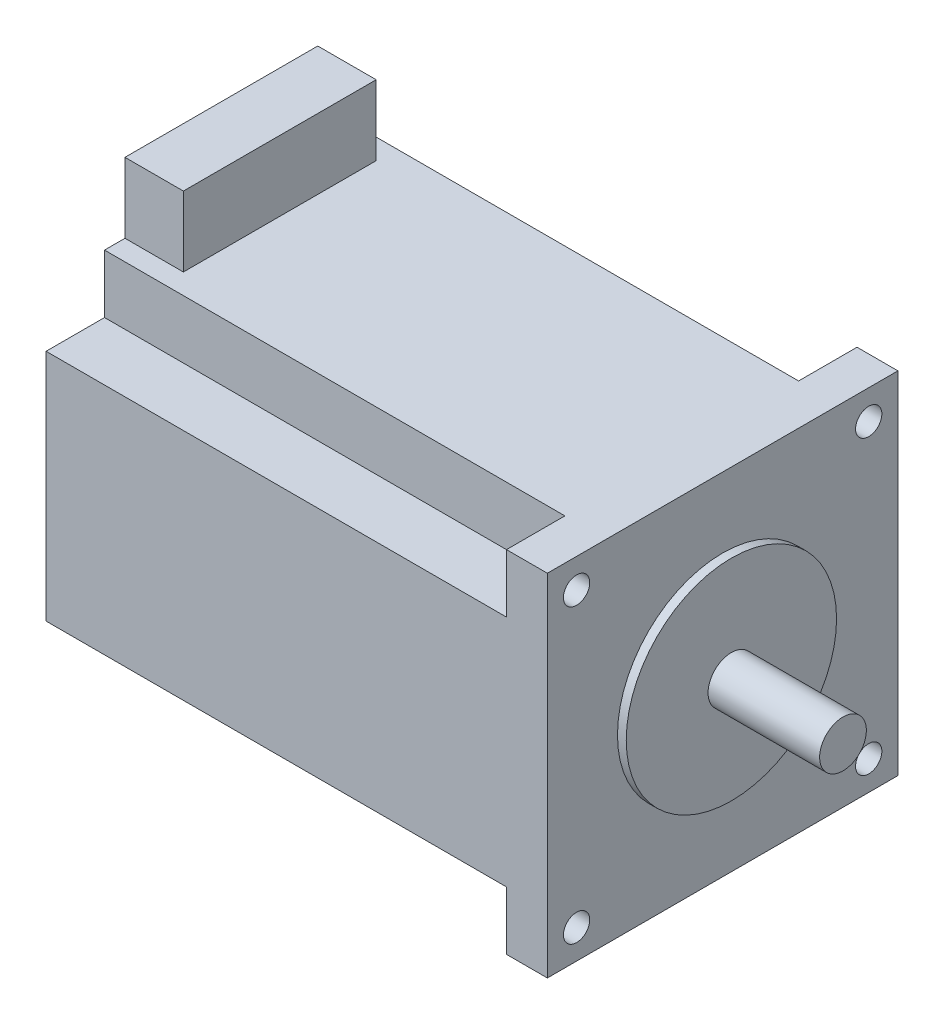
ISO-10303-21;
HEADER;
FILE_DESCRIPTION(('STEP AP214'),'2;1');
FILE_NAME('part.step','',(''),(''),'','','');
FILE_SCHEMA(('AUTOMOTIVE_DESIGN { 1 0 10303 214 1 1 1 1 }'));
ENDSEC;
DATA;
#1=APPLICATION_CONTEXT('core data for automotive mechanical design processes');
#2=APPLICATION_PROTOCOL_DEFINITION('international standard','automotive_design',2000,#1);
#3=PRODUCT_CONTEXT('',#1,'mechanical');
#4=PRODUCT('Part','Part','',(#3));
#5=PRODUCT_RELATED_PRODUCT_CATEGORY('part','',(#4));
#6=PRODUCT_DEFINITION_FORMATION('','',#4);
#7=PRODUCT_DEFINITION_CONTEXT('part definition',#1,'design');
#8=PRODUCT_DEFINITION('design','',#6,#7);
#9=PRODUCT_DEFINITION_SHAPE('','',#8);
#10=(LENGTH_UNIT() NAMED_UNIT(*) SI_UNIT(.MILLI.,.METRE.));
#11=(NAMED_UNIT(*) PLANE_ANGLE_UNIT() SI_UNIT($,.RADIAN.));
#12=(NAMED_UNIT(*) SI_UNIT($,.STERADIAN.) SOLID_ANGLE_UNIT());
#13=UNCERTAINTY_MEASURE_WITH_UNIT(LENGTH_MEASURE(1.E-05),#10,'distance_accuracy_value','');
#14=(GEOMETRIC_REPRESENTATION_CONTEXT(3) GLOBAL_UNCERTAINTY_ASSIGNED_CONTEXT((#13)) GLOBAL_UNIT_ASSIGNED_CONTEXT((#10,
#11,#12)) REPRESENTATION_CONTEXT('',''));
#15=CARTESIAN_POINT('',(0.,0.,0.));
#16=DIRECTION('',(0.,0.,1.));
#17=DIRECTION('',(1.,0.,0.));
#18=AXIS2_PLACEMENT_3D('',#15,#16,#17);
#19=CARTESIAN_POINT('',(-0.199999999999992,4.99999999999997,25.));
#20=DIRECTION('',(1.,0.,0.));
#21=DIRECTION('',(0.,1.,0.));
#22=AXIS2_PLACEMENT_3D('',#19,#20,#21);
#23=CYLINDRICAL_SURFACE('',#22,2.25);
#24=CARTESIAN_POINT('',(85.8,4.99999999999999,25.));
#25=DIRECTION('',(1.,0.,0.));
#26=DIRECTION('',(0.,0.,-1.));
#27=AXIS2_PLACEMENT_3D('',#24,#25,#26);
#28=CIRCLE('',#27,2.25);
#29=CARTESIAN_POINT('',(85.8,4.99999999999999,22.75));
#30=VERTEX_POINT('',#29);
#31=EDGE_CURVE('E283',#30,#30,#28,.T.);
#32=ORIENTED_EDGE('',*,*,#31,.T.);
#33=EDGE_LOOP('',(#32));
#34=FACE_BOUND('',#33,.T.);
#35=CARTESIAN_POINT('',(78.8,4.99999999999999,25.));
#36=DIRECTION('',(-1.,0.,0.));
#37=DIRECTION('',(0.,-1.,0.));
#38=AXIS2_PLACEMENT_3D('',#35,#36,#37);
#39=CIRCLE('',#38,2.25);
#40=CARTESIAN_POINT('',(78.8,2.74999999999999,25.));
#41=VERTEX_POINT('',#40);
#42=EDGE_CURVE('E33',#41,#41,#39,.F.);
#43=ORIENTED_EDGE('',*,*,#42,.F.);
#44=EDGE_LOOP('',(#43));
#45=FACE_BOUND('',#44,.T.);
#46=ADVANCED_FACE('F29',(#34,#45),#23,.F.);
#47=CARTESIAN_POINT('',(-0.200000000000006,55.,-25.));
#48=DIRECTION('',(1.,0.,0.));
#49=DIRECTION('',(0.,1.,0.));
#50=AXIS2_PLACEMENT_3D('',#47,#48,#49);
#51=CYLINDRICAL_SURFACE('',#50,2.25);
#52=CARTESIAN_POINT('',(85.8,55.,-25.));
#53=DIRECTION('',(1.,0.,0.));
#54=DIRECTION('',(0.,0.,-1.));
#55=AXIS2_PLACEMENT_3D('',#52,#53,#54);
#56=CIRCLE('',#55,2.25);
#57=CARTESIAN_POINT('',(85.8,55.,-27.25));
#58=VERTEX_POINT('',#57);
#59=EDGE_CURVE('E286',#58,#58,#56,.T.);
#60=ORIENTED_EDGE('',*,*,#59,.T.);
#61=EDGE_LOOP('',(#60));
#62=FACE_BOUND('',#61,.T.);
#63=CARTESIAN_POINT('',(78.8,55.,-25.));
#64=DIRECTION('',(-1.,0.,0.));
#65=DIRECTION('',(0.,-1.,0.));
#66=AXIS2_PLACEMENT_3D('',#63,#64,#65);
#67=CIRCLE('',#66,2.25);
#68=CARTESIAN_POINT('',(78.8,52.75,-25.));
#69=VERTEX_POINT('',#68);
#70=EDGE_CURVE('E276',#69,#69,#67,.F.);
#71=ORIENTED_EDGE('',*,*,#70,.F.);
#72=EDGE_LOOP('',(#71));
#73=FACE_BOUND('',#72,.T.);
#74=ADVANCED_FACE('F335',(#62,#73),#51,.F.);
#75=CARTESIAN_POINT('',(85.8,32.566827324451,30.));
#76=DIRECTION('',(1.,0.,0.));
#77=DIRECTION('',(0.,1.,0.));
#78=AXIS2_PLACEMENT_3D('',#75,#76,#77);
#79=PLANE('',#78);
#80=CARTESIAN_POINT('',(85.8,5.,-25.));
#81=DIRECTION('',(1.,0.,0.));
#82=DIRECTION('',(0.,0.,-1.));
#83=AXIS2_PLACEMENT_3D('',#80,#81,#82);
#84=CIRCLE('',#83,2.25);
#85=CARTESIAN_POINT('',(85.8,5.,-27.25));
#86=VERTEX_POINT('',#85);
#87=EDGE_CURVE('E280',#86,#86,#84,.T.);
#88=ORIENTED_EDGE('',*,*,#87,.F.);
#89=EDGE_LOOP('',(#88));
#90=FACE_BOUND('',#89,.T.);
#91=ORIENTED_EDGE('',*,*,#31,.F.);
#92=EDGE_LOOP('',(#91));
#93=FACE_BOUND('',#92,.T.);
#94=ORIENTED_EDGE('',*,*,#59,.F.);
#95=EDGE_LOOP('',(#94));
#96=FACE_BOUND('',#95,.T.);
#97=CARTESIAN_POINT('',(85.8,55.,25.));
#98=DIRECTION('',(1.,0.,0.));
#99=DIRECTION('',(0.,0.,-1.));
#100=AXIS2_PLACEMENT_3D('',#97,#98,#99);
#101=CIRCLE('',#100,2.25);
#102=CARTESIAN_POINT('',(85.8,55.,22.75));
#103=VERTEX_POINT('',#102);
#104=EDGE_CURVE('E289',#103,#103,#101,.T.);
#105=ORIENTED_EDGE('',*,*,#104,.F.);
#106=EDGE_LOOP('',(#105));
#107=FACE_BOUND('',#106,.T.);
#108=DIRECTION('',(0.,-1.,0.));
#109=VECTOR('',#108,1.);
#110=CARTESIAN_POINT('',(85.8,32.566827324451,-30.));
#111=LINE('',#110,#109);
#112=CARTESIAN_POINT('',(85.8,60.,-30.));
#113=VERTEX_POINT('',#112);
#114=CARTESIAN_POINT('',(85.8,0.,-30.));
#115=VERTEX_POINT('',#114);
#116=EDGE_CURVE('E420',#113,#115,#111,.T.);
#117=ORIENTED_EDGE('',*,*,#116,.F.);
#118=DIRECTION('',(0.,0.,-1.));
#119=VECTOR('',#118,1.);
#120=CARTESIAN_POINT('',(85.8,60.,30.));
#121=LINE('',#120,#119);
#122=CARTESIAN_POINT('',(85.8,60.,30.));
#123=VERTEX_POINT('',#122);
#124=EDGE_CURVE('E11',#123,#113,#121,.T.);
#125=ORIENTED_EDGE('',*,*,#124,.F.);
#126=DIRECTION('',(0.,-1.,0.));
#127=VECTOR('',#126,1.);
#128=CARTESIAN_POINT('',(85.8,32.566827324451,30.));
#129=LINE('',#128,#127);
#130=CARTESIAN_POINT('',(85.8,0.,30.));
#131=VERTEX_POINT('',#130);
#132=EDGE_CURVE('E201',#123,#131,#129,.T.);
#133=ORIENTED_EDGE('',*,*,#132,.T.);
#134=DIRECTION('',(0.,0.,-1.));
#135=VECTOR('',#134,1.);
#136=CARTESIAN_POINT('',(85.8,0.,30.));
#137=LINE('',#136,#135);
#138=EDGE_CURVE('E198',#131,#115,#137,.T.);
#139=ORIENTED_EDGE('',*,*,#138,.T.);
#140=EDGE_LOOP('',(#117,#125,#133,#139));
#141=FACE_BOUND('',#140,.T.);
#142=CARTESIAN_POINT('',(85.8,30.,0.));
#143=DIRECTION('',(1.,0.,0.));
#144=DIRECTION('',(0.,1.,0.));
#145=AXIS2_PLACEMENT_3D('',#142,#143,#144);
#146=CIRCLE('',#145,18.);
#147=CARTESIAN_POINT('',(85.8,48.,0.));
#148=VERTEX_POINT('',#147);
#149=EDGE_CURVE('E298',#148,#148,#146,.T.);
#150=ORIENTED_EDGE('',*,*,#149,.F.);
#151=EDGE_LOOP('',(#150));
#152=FACE_BOUND('',#151,.T.);
#153=ADVANCED_FACE('F31',(#90,#93,#96,#107,#141,#152),#79,.T.);
#154=CARTESIAN_POINT('',(-52.8710039435466,60.,30.));
#155=DIRECTION('',(0.,-1.,0.));
#156=DIRECTION('',(0.,0.,-1.));
#157=AXIS2_PLACEMENT_3D('',#154,#155,#156);
#158=PLANE('',#157);
#159=DIRECTION('',(0.,0.,-1.));
#160=VECTOR('',#159,1.);
#161=CARTESIAN_POINT('',(0.,60.,30.));
#162=LINE('',#161,#160);
#163=CARTESIAN_POINT('',(0.,60.,20.));
#164=VERTEX_POINT('',#163);
#165=CARTESIAN_POINT('',(0.,60.,16.5));
#166=VERTEX_POINT('',#165);
#167=EDGE_CURVE('E38',#164,#166,#162,.T.);
#168=ORIENTED_EDGE('',*,*,#167,.F.);
#169=DIRECTION('',(-1.,0.,0.));
#170=VECTOR('',#169,1.);
#171=CARTESIAN_POINT('',(78.8,60.,20.));
#172=LINE('',#171,#170);
#173=CARTESIAN_POINT('',(78.8,60.,20.));
#174=VERTEX_POINT('',#173);
#175=EDGE_CURVE('E251',#174,#164,#172,.T.);
#176=ORIENTED_EDGE('',*,*,#175,.F.);
#177=DIRECTION('',(0.,0.,-1.));
#178=VECTOR('',#177,1.);
#179=CARTESIAN_POINT('',(78.8,60.,30.));
#180=LINE('',#179,#178);
#181=CARTESIAN_POINT('',(78.8,60.,30.));
#182=VERTEX_POINT('',#181);
#183=EDGE_CURVE('E243',#182,#174,#180,.T.);
#184=ORIENTED_EDGE('',*,*,#183,.F.);
#185=DIRECTION('',(-1.,0.,0.));
#186=VECTOR('',#185,1.);
#187=CARTESIAN_POINT('',(-52.8710039435466,60.,30.));
#188=LINE('',#187,#186);
#189=EDGE_CURVE('E195',#123,#182,#188,.T.);
#190=ORIENTED_EDGE('',*,*,#189,.F.);
#191=ORIENTED_EDGE('',*,*,#124,.T.);
#192=DIRECTION('',(-1.,0.,0.));
#193=VECTOR('',#192,1.);
#194=CARTESIAN_POINT('',(-52.8710039435466,60.,-30.));
#195=LINE('',#194,#193);
#196=CARTESIAN_POINT('',(78.8,60.,-30.));
#197=VERTEX_POINT('',#196);
#198=EDGE_CURVE('E423',#113,#197,#195,.T.);
#199=ORIENTED_EDGE('',*,*,#198,.T.);
#200=DIRECTION('',(0.,0.,-1.));
#201=VECTOR('',#200,1.);
#202=CARTESIAN_POINT('',(78.8,60.,-30.));
#203=LINE('',#202,#201);
#204=CARTESIAN_POINT('',(78.8,60.,-20.));
#205=VERTEX_POINT('',#204);
#206=EDGE_CURVE('E270',#205,#197,#203,.T.);
#207=ORIENTED_EDGE('',*,*,#206,.F.);
#208=DIRECTION('',(-1.,0.,0.));
#209=VECTOR('',#208,1.);
#210=CARTESIAN_POINT('',(78.8,60.,-20.));
#211=LINE('',#210,#209);
#212=CARTESIAN_POINT('',(0.,60.,-20.));
#213=VERTEX_POINT('',#212);
#214=EDGE_CURVE('E273',#205,#213,#211,.T.);
#215=ORIENTED_EDGE('',*,*,#214,.T.);
#216=CARTESIAN_POINT('',(0.,60.,-16.5));
#217=VERTEX_POINT('',#216);
#218=EDGE_CURVE('E208',#217,#213,#162,.T.);
#219=ORIENTED_EDGE('',*,*,#218,.F.);
#220=DIRECTION('',(-1.,0.,0.));
#221=VECTOR('',#220,1.);
#222=CARTESIAN_POINT('',(-52.8710039435466,60.,-16.5));
#223=LINE('',#222,#221);
#224=CARTESIAN_POINT('',(9.99999999999999,60.,-16.5));
#225=VERTEX_POINT('',#224);
#226=EDGE_CURVE('E304',#225,#217,#223,.T.);
#227=ORIENTED_EDGE('',*,*,#226,.F.);
#228=DIRECTION('',(0.,0.,-1.));
#229=VECTOR('',#228,1.);
#230=CARTESIAN_POINT('',(9.99999999999999,60.,16.5));
#231=LINE('',#230,#229);
#232=CARTESIAN_POINT('',(9.99999999999999,60.,16.5));
#233=VERTEX_POINT('',#232);
#234=EDGE_CURVE('E416',#233,#225,#231,.T.);
#235=ORIENTED_EDGE('',*,*,#234,.F.);
#236=DIRECTION('',(-1.,0.,0.));
#237=VECTOR('',#236,1.);
#238=CARTESIAN_POINT('',(-52.8710039435466,60.,16.5));
#239=LINE('',#238,#237);
#240=EDGE_CURVE('E314',#233,#166,#239,.T.);
#241=ORIENTED_EDGE('',*,*,#240,.T.);
#242=EDGE_LOOP('',(#168,#176,#184,#190,#191,#199,#207,#215,#219,#227,#235,#241));
#243=FACE_BOUND('',#242,.T.);
#244=ADVANCED_FACE('F344',(#243),#158,.F.);
#245=CARTESIAN_POINT('',(0.,32.566827324451,30.));
#246=DIRECTION('',(1.,0.,0.));
#247=DIRECTION('',(0.,1.,0.));
#248=AXIS2_PLACEMENT_3D('',#245,#246,#247);
#249=PLANE('',#248);
#250=DIRECTION('',(0.,0.,-1.));
#251=VECTOR('',#250,1.);
#252=CARTESIAN_POINT('',(0.,0.,30.));
#253=LINE('',#252,#251);
#254=CARTESIAN_POINT('',(0.,0.,20.));
#255=VERTEX_POINT('',#254);
#256=CARTESIAN_POINT('',(0.,0.,-20.));
#257=VERTEX_POINT('',#256);
#258=EDGE_CURVE('E206',#255,#257,#253,.T.);
#259=ORIENTED_EDGE('',*,*,#258,.F.);
#260=DIRECTION('',(0.,-1.,0.));
#261=VECTOR('',#260,1.);
#262=CARTESIAN_POINT('',(0.,0.,20.));
#263=LINE('',#262,#261);
#264=CARTESIAN_POINT('',(0.,10.,20.));
#265=VERTEX_POINT('',#264);
#266=EDGE_CURVE('E187',#265,#255,#263,.T.);
#267=ORIENTED_EDGE('',*,*,#266,.F.);
#268=DIRECTION('',(0.,0.,-1.));
#269=VECTOR('',#268,1.);
#270=CARTESIAN_POINT('',(0.,10.,30.));
#271=LINE('',#270,#269);
#272=CARTESIAN_POINT('',(0.,10.,30.));
#273=VERTEX_POINT('',#272);
#274=EDGE_CURVE('E173',#273,#265,#271,.T.);
#275=ORIENTED_EDGE('',*,*,#274,.F.);
#276=DIRECTION('',(0.,-1.,0.));
#277=VECTOR('',#276,1.);
#278=CARTESIAN_POINT('',(0.,32.566827324451,30.));
#279=LINE('',#278,#277);
#280=CARTESIAN_POINT('',(0.,50.,30.));
#281=VERTEX_POINT('',#280);
#282=EDGE_CURVE('E186',#281,#273,#279,.T.);
#283=ORIENTED_EDGE('',*,*,#282,.F.);
#284=DIRECTION('',(0.,0.,1.));
#285=VECTOR('',#284,1.);
#286=CARTESIAN_POINT('',(0.,50.,30.));
#287=LINE('',#286,#285);
#288=CARTESIAN_POINT('',(0.,50.,20.));
#289=VERTEX_POINT('',#288);
#290=EDGE_CURVE('E224',#289,#281,#287,.T.);
#291=ORIENTED_EDGE('',*,*,#290,.F.);
#292=DIRECTION('',(0.,-1.,0.));
#293=VECTOR('',#292,1.);
#294=CARTESIAN_POINT('',(0.,60.,20.));
#295=LINE('',#294,#293);
#296=EDGE_CURVE('E219',#164,#289,#295,.T.);
#297=ORIENTED_EDGE('',*,*,#296,.F.);
#298=ORIENTED_EDGE('',*,*,#167,.T.);
#299=DIRECTION('',(0.,-1.,0.));
#300=VECTOR('',#299,1.);
#301=CARTESIAN_POINT('',(0.,32.5668273244509,16.5));
#302=LINE('',#301,#300);
#303=CARTESIAN_POINT('',(0.,72.,16.5));
#304=VERTEX_POINT('',#303);
#305=EDGE_CURVE('E317',#304,#166,#302,.T.);
#306=ORIENTED_EDGE('',*,*,#305,.F.);
#307=DIRECTION('',(0.,0.,-1.));
#308=VECTOR('',#307,1.);
#309=CARTESIAN_POINT('',(0.,72.,16.5));
#310=LINE('',#309,#308);
#311=CARTESIAN_POINT('',(0.,72.,-16.5));
#312=VERTEX_POINT('',#311);
#313=EDGE_CURVE('E320',#304,#312,#310,.T.);
#314=ORIENTED_EDGE('',*,*,#313,.T.);
#315=DIRECTION('',(0.,-1.,0.));
#316=VECTOR('',#315,1.);
#317=CARTESIAN_POINT('',(0.,32.5668273244509,-16.5));
#318=LINE('',#317,#316);
#319=EDGE_CURVE('E309',#312,#217,#318,.T.);
#320=ORIENTED_EDGE('',*,*,#319,.T.);
#321=ORIENTED_EDGE('',*,*,#218,.T.);
#322=DIRECTION('',(0.,1.,0.));
#323=VECTOR('',#322,1.);
#324=CARTESIAN_POINT('',(0.,60.,-20.));
#325=LINE('',#324,#323);
#326=CARTESIAN_POINT('',(0.,50.,-20.));
#327=VERTEX_POINT('',#326);
#328=EDGE_CURVE('E259',#327,#213,#325,.T.);
#329=ORIENTED_EDGE('',*,*,#328,.F.);
#330=DIRECTION('',(0.,0.,1.));
#331=VECTOR('',#330,1.);
#332=CARTESIAN_POINT('',(0.,50.,-30.));
#333=LINE('',#332,#331);
#334=CARTESIAN_POINT('',(0.,50.,-30.));
#335=VERTEX_POINT('',#334);
#336=EDGE_CURVE('E256',#335,#327,#333,.T.);
#337=ORIENTED_EDGE('',*,*,#336,.F.);
#338=DIRECTION('',(0.,-1.,0.));
#339=VECTOR('',#338,1.);
#340=CARTESIAN_POINT('',(0.,32.566827324451,-30.));
#341=LINE('',#340,#339);
#342=CARTESIAN_POINT('',(0.,10.,-30.));
#343=VERTEX_POINT('',#342);
#344=EDGE_CURVE('E426',#335,#343,#341,.T.);
#345=ORIENTED_EDGE('',*,*,#344,.T.);
#346=DIRECTION('',(0.,0.,-1.));
#347=VECTOR('',#346,1.);
#348=CARTESIAN_POINT('',(0.,10.,-30.));
#349=LINE('',#348,#347);
#350=CARTESIAN_POINT('',(0.,10.,-20.));
#351=VERTEX_POINT('',#350);
#352=EDGE_CURVE('E498',#351,#343,#349,.T.);
#353=ORIENTED_EDGE('',*,*,#352,.F.);
#354=DIRECTION('',(0.,1.,0.));
#355=VECTOR('',#354,1.);
#356=CARTESIAN_POINT('',(0.,0.,-20.));
#357=LINE('',#356,#355);
#358=EDGE_CURVE('E495',#257,#351,#357,.T.);
#359=ORIENTED_EDGE('',*,*,#358,.F.);
#360=EDGE_LOOP('',(#259,#267,#275,#283,#291,#297,#298,#306,#314,#320,#321,#329,#337,#345,#353,#359));
#361=FACE_BOUND('',#360,.T.);
#362=ADVANCED_FACE('F184',(#361),#249,.F.);
#363=CARTESIAN_POINT('',(-52.8710039435466,0.,30.));
#364=DIRECTION('',(0.,-1.,0.));
#365=DIRECTION('',(0.,0.,-1.));
#366=AXIS2_PLACEMENT_3D('',#363,#364,#365);
#367=PLANE('',#366);
#368=DIRECTION('',(-1.,0.,0.));
#369=VECTOR('',#368,1.);
#370=CARTESIAN_POINT('',(78.8,0.,20.));
#371=LINE('',#370,#369);
#372=CARTESIAN_POINT('',(78.8,0.,20.));
#373=VERTEX_POINT('',#372);
#374=EDGE_CURVE('E496',#373,#255,#371,.T.);
#375=ORIENTED_EDGE('',*,*,#374,.T.);
#376=ORIENTED_EDGE('',*,*,#258,.T.);
#377=DIRECTION('',(-1.,0.,0.));
#378=VECTOR('',#377,1.);
#379=CARTESIAN_POINT('',(78.8,0.,-20.));
#380=LINE('',#379,#378);
#381=CARTESIAN_POINT('',(78.8,0.,-20.));
#382=VERTEX_POINT('',#381);
#383=EDGE_CURVE('E233',#382,#257,#380,.T.);
#384=ORIENTED_EDGE('',*,*,#383,.F.);
#385=DIRECTION('',(0.,0.,1.));
#386=VECTOR('',#385,1.);
#387=CARTESIAN_POINT('',(78.8,0.,-30.));
#388=LINE('',#387,#386);
#389=CARTESIAN_POINT('',(78.8,0.,-30.));
#390=VERTEX_POINT('',#389);
#391=EDGE_CURVE('E443',#390,#382,#388,.T.);
#392=ORIENTED_EDGE('',*,*,#391,.F.);
#393=DIRECTION('',(-1.,0.,0.));
#394=VECTOR('',#393,1.);
#395=CARTESIAN_POINT('',(-52.8710039435466,0.,-30.));
#396=LINE('',#395,#394);
#397=EDGE_CURVE('E428',#115,#390,#396,.T.);
#398=ORIENTED_EDGE('',*,*,#397,.F.);
#399=ORIENTED_EDGE('',*,*,#138,.F.);
#400=DIRECTION('',(-1.,0.,0.));
#401=VECTOR('',#400,1.);
#402=CARTESIAN_POINT('',(-52.8710039435466,0.,30.));
#403=LINE('',#402,#401);
#404=CARTESIAN_POINT('',(78.8,0.,30.));
#405=VERTEX_POINT('',#404);
#406=EDGE_CURVE('E194',#131,#405,#403,.T.);
#407=ORIENTED_EDGE('',*,*,#406,.T.);
#408=DIRECTION('',(0.,0.,1.));
#409=VECTOR('',#408,1.);
#410=CARTESIAN_POINT('',(78.8,0.,30.));
#411=LINE('',#410,#409);
#412=EDGE_CURVE('E46',#373,#405,#411,.T.);
#413=ORIENTED_EDGE('',*,*,#412,.F.);
#414=EDGE_LOOP('',(#375,#376,#384,#392,#398,#399,#407,#413));
#415=FACE_BOUND('',#414,.T.);
#416=ADVANCED_FACE('F392',(#415),#367,.T.);
#417=CARTESIAN_POINT('',(-52.8710039435466,32.566827324451,30.));
#418=DIRECTION('',(0.,0.,-1.));
#419=DIRECTION('',(-1.,0.,0.));
#420=AXIS2_PLACEMENT_3D('',#417,#418,#419);
#421=PLANE('',#420);
#422=ORIENTED_EDGE('',*,*,#282,.T.);
#423=DIRECTION('',(-1.,0.,0.));
#424=VECTOR('',#423,1.);
#425=CARTESIAN_POINT('',(78.8,10.,30.));
#426=LINE('',#425,#424);
#427=CARTESIAN_POINT('',(78.8,10.,30.));
#428=VERTEX_POINT('',#427);
#429=EDGE_CURVE('E170',#428,#273,#426,.T.);
#430=ORIENTED_EDGE('',*,*,#429,.F.);
#431=DIRECTION('',(0.,1.,0.));
#432=VECTOR('',#431,1.);
#433=CARTESIAN_POINT('',(78.8,0.,30.));
#434=LINE('',#433,#432);
#435=EDGE_CURVE('E437',#405,#428,#434,.T.);
#436=ORIENTED_EDGE('',*,*,#435,.F.);
#437=ORIENTED_EDGE('',*,*,#406,.F.);
#438=ORIENTED_EDGE('',*,*,#132,.F.);
#439=ORIENTED_EDGE('',*,*,#189,.T.);
#440=DIRECTION('',(0.,1.,0.));
#441=VECTOR('',#440,1.);
#442=CARTESIAN_POINT('',(78.8,60.,30.));
#443=LINE('',#442,#441);
#444=CARTESIAN_POINT('',(78.8,50.,30.));
#445=VERTEX_POINT('',#444);
#446=EDGE_CURVE('E241',#445,#182,#443,.T.);
#447=ORIENTED_EDGE('',*,*,#446,.F.);
#448=DIRECTION('',(-1.,0.,0.));
#449=VECTOR('',#448,1.);
#450=CARTESIAN_POINT('',(78.8,50.,30.));
#451=LINE('',#450,#449);
#452=EDGE_CURVE('E193',#445,#281,#451,.T.);
#453=ORIENTED_EDGE('',*,*,#452,.T.);
#454=EDGE_LOOP('',(#422,#430,#436,#437,#438,#439,#447,#453));
#455=FACE_BOUND('',#454,.T.);
#456=ADVANCED_FACE('F190',(#455),#421,.F.);
#457=CARTESIAN_POINT('',(-52.8710039435466,32.566827324451,-30.));
#458=DIRECTION('',(0.,0.,-1.));
#459=DIRECTION('',(-1.,0.,0.));
#460=AXIS2_PLACEMENT_3D('',#457,#458,#459);
#461=PLANE('',#460);
#462=DIRECTION('',(-1.,0.,0.));
#463=VECTOR('',#462,1.);
#464=CARTESIAN_POINT('',(78.8,10.,-30.));
#465=LINE('',#464,#463);
#466=CARTESIAN_POINT('',(78.8,10.,-30.));
#467=VERTEX_POINT('',#466);
#468=EDGE_CURVE('E220',#467,#343,#465,.T.);
#469=ORIENTED_EDGE('',*,*,#468,.T.);
#470=ORIENTED_EDGE('',*,*,#344,.F.);
#471=DIRECTION('',(-1.,0.,0.));
#472=VECTOR('',#471,1.);
#473=CARTESIAN_POINT('',(78.8,50.,-30.));
#474=LINE('',#473,#472);
#475=CARTESIAN_POINT('',(78.8,50.,-30.));
#476=VERTEX_POINT('',#475);
#477=EDGE_CURVE('E272',#476,#335,#474,.T.);
#478=ORIENTED_EDGE('',*,*,#477,.F.);
#479=DIRECTION('',(0.,-1.,0.));
#480=VECTOR('',#479,1.);
#481=CARTESIAN_POINT('',(78.8,60.,-30.));
#482=LINE('',#481,#480);
#483=EDGE_CURVE('E261',#197,#476,#482,.T.);
#484=ORIENTED_EDGE('',*,*,#483,.F.);
#485=ORIENTED_EDGE('',*,*,#198,.F.);
#486=ORIENTED_EDGE('',*,*,#116,.T.);
#487=ORIENTED_EDGE('',*,*,#397,.T.);
#488=DIRECTION('',(0.,-1.,0.));
#489=VECTOR('',#488,1.);
#490=CARTESIAN_POINT('',(78.8,0.,-30.));
#491=LINE('',#490,#489);
#492=EDGE_CURVE('E444',#467,#390,#491,.T.);
#493=ORIENTED_EDGE('',*,*,#492,.F.);
#494=EDGE_LOOP('',(#469,#470,#478,#484,#485,#486,#487,#493));
#495=FACE_BOUND('',#494,.T.);
#496=ADVANCED_FACE('F386',(#495),#461,.T.);
#497=CARTESIAN_POINT('',(9.99999999999999,32.566827324451,16.5));
#498=DIRECTION('',(-1.,0.,0.));
#499=DIRECTION('',(0.,0.,1.));
#500=AXIS2_PLACEMENT_3D('',#497,#498,#499);
#501=PLANE('',#500);
#502=DIRECTION('',(0.,1.,0.));
#503=VECTOR('',#502,1.);
#504=CARTESIAN_POINT('',(9.99999999999999,32.566827324451,-16.5));
#505=LINE('',#504,#503);
#506=CARTESIAN_POINT('',(9.99999999999999,72.,-16.5));
#507=VERTEX_POINT('',#506);
#508=EDGE_CURVE('E305',#225,#507,#505,.T.);
#509=ORIENTED_EDGE('',*,*,#508,.T.);
#510=DIRECTION('',(0.,0.,-1.));
#511=VECTOR('',#510,1.);
#512=CARTESIAN_POINT('',(9.99999999999999,72.,16.5));
#513=LINE('',#512,#511);
#514=CARTESIAN_POINT('',(9.99999999999999,72.,16.5));
#515=VERTEX_POINT('',#514);
#516=EDGE_CURVE('E414',#515,#507,#513,.T.);
#517=ORIENTED_EDGE('',*,*,#516,.F.);
#518=DIRECTION('',(0.,1.,0.));
#519=VECTOR('',#518,1.);
#520=CARTESIAN_POINT('',(9.99999999999999,32.566827324451,16.5));
#521=LINE('',#520,#519);
#522=EDGE_CURVE('E312',#233,#515,#521,.T.);
#523=ORIENTED_EDGE('',*,*,#522,.F.);
#524=ORIENTED_EDGE('',*,*,#234,.T.);
#525=EDGE_LOOP('',(#509,#517,#523,#524));
#526=FACE_BOUND('',#525,.T.);
#527=ADVANCED_FACE('F382',(#526),#501,.F.);
#528=CARTESIAN_POINT('',(-52.8710039435466,72.,16.5));
#529=DIRECTION('',(0.,-1.,0.));
#530=DIRECTION('',(0.,0.,-1.));
#531=AXIS2_PLACEMENT_3D('',#528,#529,#530);
#532=PLANE('',#531);
#533=DIRECTION('',(-1.,0.,0.));
#534=VECTOR('',#533,1.);
#535=CARTESIAN_POINT('',(-52.8710039435466,72.,-16.5));
#536=LINE('',#535,#534);
#537=EDGE_CURVE('E307',#507,#312,#536,.T.);
#538=ORIENTED_EDGE('',*,*,#537,.T.);
#539=ORIENTED_EDGE('',*,*,#313,.F.);
#540=DIRECTION('',(-1.,0.,0.));
#541=VECTOR('',#540,1.);
#542=CARTESIAN_POINT('',(-52.8710039435466,72.,16.5));
#543=LINE('',#542,#541);
#544=EDGE_CURVE('E321',#515,#304,#543,.T.);
#545=ORIENTED_EDGE('',*,*,#544,.F.);
#546=ORIENTED_EDGE('',*,*,#516,.T.);
#547=EDGE_LOOP('',(#538,#539,#545,#546));
#548=FACE_BOUND('',#547,.T.);
#549=ADVANCED_FACE('F378',(#548),#532,.F.);
#550=CARTESIAN_POINT('',(-52.8710039435466,32.566827324451,16.5));
#551=DIRECTION('',(0.,0.,-1.));
#552=DIRECTION('',(-1.,0.,0.));
#553=AXIS2_PLACEMENT_3D('',#550,#551,#552);
#554=PLANE('',#553);
#555=ORIENTED_EDGE('',*,*,#240,.F.);
#556=ORIENTED_EDGE('',*,*,#522,.T.);
#557=ORIENTED_EDGE('',*,*,#544,.T.);
#558=ORIENTED_EDGE('',*,*,#305,.T.);
#559=EDGE_LOOP('',(#555,#556,#557,#558));
#560=FACE_BOUND('',#559,.T.);
#561=ADVANCED_FACE('F374',(#560),#554,.F.);
#562=CARTESIAN_POINT('',(-52.8710039435466,32.566827324451,-16.5));
#563=DIRECTION('',(0.,0.,-1.));
#564=DIRECTION('',(-1.,0.,0.));
#565=AXIS2_PLACEMENT_3D('',#562,#563,#564);
#566=PLANE('',#565);
#567=ORIENTED_EDGE('',*,*,#226,.T.);
#568=ORIENTED_EDGE('',*,*,#319,.F.);
#569=ORIENTED_EDGE('',*,*,#537,.F.);
#570=ORIENTED_EDGE('',*,*,#508,.F.);
#571=EDGE_LOOP('',(#567,#568,#569,#570));
#572=FACE_BOUND('',#571,.T.);
#573=ADVANCED_FACE('F367',(#572),#566,.T.);
#574=CARTESIAN_POINT('',(87.3,30.,0.));
#575=DIRECTION('',(1.,0.,0.));
#576=DIRECTION('',(0.,1.,0.));
#577=AXIS2_PLACEMENT_3D('',#574,#575,#576);
#578=PLANE('',#577);
#579=CARTESIAN_POINT('',(87.3,30.,0.));
#580=DIRECTION('',(1.,0.,0.));
#581=DIRECTION('',(0.,1.,0.));
#582=AXIS2_PLACEMENT_3D('',#579,#580,#581);
#583=CIRCLE('',#582,18.);
#584=CARTESIAN_POINT('',(87.3,48.,0.));
#585=VERTEX_POINT('',#584);
#586=EDGE_CURVE('E301',#585,#585,#583,.T.);
#587=ORIENTED_EDGE('',*,*,#586,.T.);
#588=EDGE_LOOP('',(#587));
#589=FACE_BOUND('',#588,.T.);
#590=CARTESIAN_POINT('',(87.3,30.,0.));
#591=DIRECTION('',(1.,0.,0.));
#592=DIRECTION('',(0.,1.,0.));
#593=AXIS2_PLACEMENT_3D('',#590,#591,#592);
#594=CIRCLE('',#593,4.);
#595=CARTESIAN_POINT('',(87.3,34.,0.));
#596=VERTEX_POINT('',#595);
#597=EDGE_CURVE('E295',#596,#596,#594,.T.);
#598=ORIENTED_EDGE('',*,*,#597,.F.);
#599=EDGE_LOOP('',(#598));
#600=FACE_BOUND('',#599,.T.);
#601=ADVANCED_FACE('F364',(#589,#600),#578,.T.);
#602=CARTESIAN_POINT('',(87.3,30.,0.));
#603=DIRECTION('',(-1.,0.,0.));
#604=DIRECTION('',(0.,-1.,0.));
#605=AXIS2_PLACEMENT_3D('',#602,#603,#604);
#606=CYLINDRICAL_SURFACE('',#605,18.);
#607=ORIENTED_EDGE('',*,*,#586,.F.);
#608=EDGE_LOOP('',(#607));
#609=FACE_BOUND('',#608,.T.);
#610=ORIENTED_EDGE('',*,*,#149,.T.);
#611=EDGE_LOOP('',(#610));
#612=FACE_BOUND('',#611,.T.);
#613=ADVANCED_FACE('F362',(#609,#612),#606,.T.);
#614=CARTESIAN_POINT('',(106.4,30.,0.));
#615=DIRECTION('',(-1.,0.,0.));
#616=DIRECTION('',(0.,-1.,0.));
#617=AXIS2_PLACEMENT_3D('',#614,#615,#616);
#618=CYLINDRICAL_SURFACE('',#617,4.);
#619=ORIENTED_EDGE('',*,*,#597,.T.);
#620=EDGE_LOOP('',(#619));
#621=FACE_BOUND('',#620,.T.);
#622=CARTESIAN_POINT('',(106.4,30.,0.));
#623=DIRECTION('',(1.,0.,0.));
#624=DIRECTION('',(0.,1.,0.));
#625=AXIS2_PLACEMENT_3D('',#622,#623,#624);
#626=CIRCLE('',#625,4.);
#627=CARTESIAN_POINT('',(106.4,34.,0.));
#628=VERTEX_POINT('',#627);
#629=EDGE_CURVE('E292',#628,#628,#626,.T.);
#630=ORIENTED_EDGE('',*,*,#629,.F.);
#631=EDGE_LOOP('',(#630));
#632=FACE_BOUND('',#631,.T.);
#633=ADVANCED_FACE('F358',(#621,#632),#618,.T.);
#634=CARTESIAN_POINT('',(106.4,30.,0.));
#635=DIRECTION('',(1.,0.,0.));
#636=DIRECTION('',(0.,1.,0.));
#637=AXIS2_PLACEMENT_3D('',#634,#635,#636);
#638=PLANE('',#637);
#639=ORIENTED_EDGE('',*,*,#629,.T.);
#640=EDGE_LOOP('',(#639));
#641=FACE_BOUND('',#640,.T.);
#642=ADVANCED_FACE('F354',(#641),#638,.T.);
#643=CARTESIAN_POINT('',(-0.200000000000006,55.,25.));
#644=DIRECTION('',(1.,0.,0.));
#645=DIRECTION('',(0.,1.,0.));
#646=AXIS2_PLACEMENT_3D('',#643,#644,#645);
#647=CYLINDRICAL_SURFACE('',#646,2.25);
#648=CARTESIAN_POINT('',(78.8,55.,25.));
#649=DIRECTION('',(1.,0.,0.));
#650=DIRECTION('',(0.,1.,0.));
#651=AXIS2_PLACEMENT_3D('',#648,#649,#650);
#652=CIRCLE('',#651,2.25);
#653=CARTESIAN_POINT('',(78.8,57.25,25.));
#654=VERTEX_POINT('',#653);
#655=EDGE_CURVE('E215',#654,#654,#652,.F.);
#656=ORIENTED_EDGE('',*,*,#655,.T.);
#657=EDGE_LOOP('',(#656));
#658=FACE_BOUND('',#657,.T.);
#659=ORIENTED_EDGE('',*,*,#104,.T.);
#660=EDGE_LOOP('',(#659));
#661=FACE_BOUND('',#660,.T.);
#662=ADVANCED_FACE('F350',(#658,#661),#647,.F.);
#663=CARTESIAN_POINT('',(-0.199999999999992,4.99999999999998,-25.));
#664=DIRECTION('',(1.,0.,0.));
#665=DIRECTION('',(0.,1.,0.));
#666=AXIS2_PLACEMENT_3D('',#663,#664,#665);
#667=CYLINDRICAL_SURFACE('',#666,2.25);
#668=CARTESIAN_POINT('',(78.8,4.99999999999999,-25.));
#669=DIRECTION('',(1.,0.,0.));
#670=DIRECTION('',(0.,1.,0.));
#671=AXIS2_PLACEMENT_3D('',#668,#669,#670);
#672=CIRCLE('',#671,2.25);
#673=CARTESIAN_POINT('',(78.8,7.24999999999999,-25.));
#674=VERTEX_POINT('',#673);
#675=EDGE_CURVE('E217',#674,#674,#672,.F.);
#676=ORIENTED_EDGE('',*,*,#675,.T.);
#677=EDGE_LOOP('',(#676));
#678=FACE_BOUND('',#677,.T.);
#679=ORIENTED_EDGE('',*,*,#87,.T.);
#680=EDGE_LOOP('',(#679));
#681=FACE_BOUND('',#680,.T.);
#682=ADVANCED_FACE('F353',(#678,#681),#667,.F.);
#683=CARTESIAN_POINT('',(78.8,50.,-30.));
#684=DIRECTION('',(-1.,0.,0.));
#685=DIRECTION('',(0.,-1.,0.));
#686=AXIS2_PLACEMENT_3D('',#683,#684,#685);
#687=PLANE('',#686);
#688=ORIENTED_EDGE('',*,*,#483,.T.);
#689=DIRECTION('',(0.,0.,1.));
#690=VECTOR('',#689,1.);
#691=CARTESIAN_POINT('',(78.8,50.,-30.));
#692=LINE('',#691,#690);
#693=CARTESIAN_POINT('',(78.8,50.,-20.));
#694=VERTEX_POINT('',#693);
#695=EDGE_CURVE('E264',#476,#694,#692,.T.);
#696=ORIENTED_EDGE('',*,*,#695,.T.);
#697=DIRECTION('',(0.,1.,0.));
#698=VECTOR('',#697,1.);
#699=CARTESIAN_POINT('',(78.8,60.,-20.));
#700=LINE('',#699,#698);
#701=EDGE_CURVE('E267',#694,#205,#700,.T.);
#702=ORIENTED_EDGE('',*,*,#701,.T.);
#703=ORIENTED_EDGE('',*,*,#206,.T.);
#704=EDGE_LOOP('',(#688,#696,#702,#703));
#705=FACE_BOUND('',#704,.T.);
#706=ORIENTED_EDGE('',*,*,#70,.T.);
#707=EDGE_LOOP('',(#706));
#708=FACE_BOUND('',#707,.T.);
#709=ADVANCED_FACE('F333',(#705,#708),#687,.T.);
#710=CARTESIAN_POINT('',(78.8,60.,-20.));
#711=DIRECTION('',(0.,0.,1.));
#712=DIRECTION('',(1.,0.,0.));
#713=AXIS2_PLACEMENT_3D('',#710,#711,#712);
#714=PLANE('',#713);
#715=ORIENTED_EDGE('',*,*,#328,.T.);
#716=ORIENTED_EDGE('',*,*,#214,.F.);
#717=ORIENTED_EDGE('',*,*,#701,.F.);
#718=DIRECTION('',(-1.,0.,0.));
#719=VECTOR('',#718,1.);
#720=CARTESIAN_POINT('',(78.8,50.,-20.));
#721=LINE('',#720,#719);
#722=EDGE_CURVE('E277',#694,#327,#721,.T.);
#723=ORIENTED_EDGE('',*,*,#722,.T.);
#724=EDGE_LOOP('',(#715,#716,#717,#723));
#725=FACE_BOUND('',#724,.T.);
#726=ADVANCED_FACE('F471',(#725),#714,.F.);
#727=CARTESIAN_POINT('',(78.8,50.,-30.));
#728=DIRECTION('',(0.,-1.,0.));
#729=DIRECTION('',(1.,0.,0.));
#730=AXIS2_PLACEMENT_3D('',#727,#728,#729);
#731=PLANE('',#730);
#732=ORIENTED_EDGE('',*,*,#336,.T.);
#733=ORIENTED_EDGE('',*,*,#722,.F.);
#734=ORIENTED_EDGE('',*,*,#695,.F.);
#735=ORIENTED_EDGE('',*,*,#477,.T.);
#736=EDGE_LOOP('',(#732,#733,#734,#735));
#737=FACE_BOUND('',#736,.T.);
#738=ADVANCED_FACE('F475',(#737),#731,.F.);
#739=CARTESIAN_POINT('',(78.8,50.,30.));
#740=DIRECTION('',(1.,0.,0.));
#741=DIRECTION('',(0.,1.,0.));
#742=AXIS2_PLACEMENT_3D('',#739,#740,#741);
#743=PLANE('',#742);
#744=ORIENTED_EDGE('',*,*,#446,.T.);
#745=ORIENTED_EDGE('',*,*,#183,.T.);
#746=DIRECTION('',(0.,-1.,0.));
#747=VECTOR('',#746,1.);
#748=CARTESIAN_POINT('',(78.8,60.,20.));
#749=LINE('',#748,#747);
#750=CARTESIAN_POINT('',(78.8,50.,20.));
#751=VERTEX_POINT('',#750);
#752=EDGE_CURVE('E246',#174,#751,#749,.T.);
#753=ORIENTED_EDGE('',*,*,#752,.T.);
#754=DIRECTION('',(0.,0.,1.));
#755=VECTOR('',#754,1.);
#756=CARTESIAN_POINT('',(78.8,50.,30.));
#757=LINE('',#756,#755);
#758=EDGE_CURVE('E249',#751,#445,#757,.T.);
#759=ORIENTED_EDGE('',*,*,#758,.T.);
#760=EDGE_LOOP('',(#744,#745,#753,#759));
#761=FACE_BOUND('',#760,.T.);
#762=ORIENTED_EDGE('',*,*,#655,.F.);
#763=EDGE_LOOP('',(#762));
#764=FACE_BOUND('',#763,.T.);
#765=ADVANCED_FACE('F450',(#761,#764),#743,.F.);
#766=CARTESIAN_POINT('',(78.8,50.,30.));
#767=DIRECTION('',(0.,-1.,0.));
#768=DIRECTION('',(1.,0.,0.));
#769=AXIS2_PLACEMENT_3D('',#766,#767,#768);
#770=PLANE('',#769);
#771=ORIENTED_EDGE('',*,*,#290,.T.);
#772=ORIENTED_EDGE('',*,*,#452,.F.);
#773=ORIENTED_EDGE('',*,*,#758,.F.);
#774=DIRECTION('',(-1.,0.,0.));
#775=VECTOR('',#774,1.);
#776=CARTESIAN_POINT('',(78.8,50.,20.));
#777=LINE('',#776,#775);
#778=EDGE_CURVE('E253',#751,#289,#777,.T.);
#779=ORIENTED_EDGE('',*,*,#778,.T.);
#780=EDGE_LOOP('',(#771,#772,#773,#779));
#781=FACE_BOUND('',#780,.T.);
#782=ADVANCED_FACE('F454',(#781),#770,.F.);
#783=CARTESIAN_POINT('',(78.8,60.,20.));
#784=DIRECTION('',(0.,0.,-1.));
#785=DIRECTION('',(-1.,0.,0.));
#786=AXIS2_PLACEMENT_3D('',#783,#784,#785);
#787=PLANE('',#786);
#788=ORIENTED_EDGE('',*,*,#296,.T.);
#789=ORIENTED_EDGE('',*,*,#778,.F.);
#790=ORIENTED_EDGE('',*,*,#752,.F.);
#791=ORIENTED_EDGE('',*,*,#175,.T.);
#792=EDGE_LOOP('',(#788,#789,#790,#791));
#793=FACE_BOUND('',#792,.T.);
#794=ADVANCED_FACE('F456',(#793),#787,.F.);
#795=CARTESIAN_POINT('',(78.8,10.,-30.));
#796=DIRECTION('',(1.,0.,0.));
#797=DIRECTION('',(0.,1.,0.));
#798=AXIS2_PLACEMENT_3D('',#795,#796,#797);
#799=PLANE('',#798);
#800=ORIENTED_EDGE('',*,*,#492,.T.);
#801=ORIENTED_EDGE('',*,*,#391,.T.);
#802=DIRECTION('',(0.,1.,0.));
#803=VECTOR('',#802,1.);
#804=CARTESIAN_POINT('',(78.8,0.,-20.));
#805=LINE('',#804,#803);
#806=CARTESIAN_POINT('',(78.8,10.,-20.));
#807=VERTEX_POINT('',#806);
#808=EDGE_CURVE('E507',#382,#807,#805,.T.);
#809=ORIENTED_EDGE('',*,*,#808,.T.);
#810=DIRECTION('',(0.,0.,-1.));
#811=VECTOR('',#810,1.);
#812=CARTESIAN_POINT('',(78.8,10.,-30.));
#813=LINE('',#812,#811);
#814=EDGE_CURVE('E54',#807,#467,#813,.T.);
#815=ORIENTED_EDGE('',*,*,#814,.T.);
#816=EDGE_LOOP('',(#800,#801,#809,#815));
#817=FACE_BOUND('',#816,.T.);
#818=ORIENTED_EDGE('',*,*,#675,.F.);
#819=EDGE_LOOP('',(#818));
#820=FACE_BOUND('',#819,.T.);
#821=ADVANCED_FACE('F458',(#817,#820),#799,.F.);
#822=CARTESIAN_POINT('',(78.8,10.,-30.));
#823=DIRECTION('',(0.,1.,0.));
#824=DIRECTION('',(-1.,0.,0.));
#825=AXIS2_PLACEMENT_3D('',#822,#823,#824);
#826=PLANE('',#825);
#827=ORIENTED_EDGE('',*,*,#352,.T.);
#828=ORIENTED_EDGE('',*,*,#468,.F.);
#829=ORIENTED_EDGE('',*,*,#814,.F.);
#830=DIRECTION('',(-1.,0.,0.));
#831=VECTOR('',#830,1.);
#832=CARTESIAN_POINT('',(78.8,10.,-20.));
#833=LINE('',#832,#831);
#834=EDGE_CURVE('E227',#807,#351,#833,.T.);
#835=ORIENTED_EDGE('',*,*,#834,.T.);
#836=EDGE_LOOP('',(#827,#828,#829,#835));
#837=FACE_BOUND('',#836,.T.);
#838=ADVANCED_FACE('F464',(#837),#826,.F.);
#839=CARTESIAN_POINT('',(78.8,0.,-20.));
#840=DIRECTION('',(0.,0.,1.));
#841=DIRECTION('',(1.,0.,0.));
#842=AXIS2_PLACEMENT_3D('',#839,#840,#841);
#843=PLANE('',#842);
#844=ORIENTED_EDGE('',*,*,#358,.T.);
#845=ORIENTED_EDGE('',*,*,#834,.F.);
#846=ORIENTED_EDGE('',*,*,#808,.F.);
#847=ORIENTED_EDGE('',*,*,#383,.T.);
#848=EDGE_LOOP('',(#844,#845,#846,#847));
#849=FACE_BOUND('',#848,.T.);
#850=ADVANCED_FACE('F520',(#849),#843,.F.);
#851=CARTESIAN_POINT('',(78.8,0.,30.));
#852=DIRECTION('',(-1.,0.,0.));
#853=DIRECTION('',(0.,-1.,0.));
#854=AXIS2_PLACEMENT_3D('',#851,#852,#853);
#855=PLANE('',#854);
#856=ORIENTED_EDGE('',*,*,#435,.T.);
#857=DIRECTION('',(0.,0.,-1.));
#858=VECTOR('',#857,1.);
#859=CARTESIAN_POINT('',(78.8,10.,30.));
#860=LINE('',#859,#858);
#861=CARTESIAN_POINT('',(78.8,10.,20.));
#862=VERTEX_POINT('',#861);
#863=EDGE_CURVE('E176',#428,#862,#860,.T.);
#864=ORIENTED_EDGE('',*,*,#863,.T.);
#865=DIRECTION('',(0.,-1.,0.));
#866=VECTOR('',#865,1.);
#867=CARTESIAN_POINT('',(78.8,0.,20.));
#868=LINE('',#867,#866);
#869=EDGE_CURVE('E575',#862,#373,#868,.T.);
#870=ORIENTED_EDGE('',*,*,#869,.T.);
#871=ORIENTED_EDGE('',*,*,#412,.T.);
#872=EDGE_LOOP('',(#856,#864,#870,#871));
#873=FACE_BOUND('',#872,.T.);
#874=ORIENTED_EDGE('',*,*,#42,.T.);
#875=EDGE_LOOP('',(#874));
#876=FACE_BOUND('',#875,.T.);
#877=ADVANCED_FACE('F522',(#873,#876),#855,.T.);
#878=CARTESIAN_POINT('',(78.8,0.,20.));
#879=DIRECTION('',(0.,0.,-1.));
#880=DIRECTION('',(-1.,0.,0.));
#881=AXIS2_PLACEMENT_3D('',#878,#879,#880);
#882=PLANE('',#881);
#883=ORIENTED_EDGE('',*,*,#266,.T.);
#884=ORIENTED_EDGE('',*,*,#374,.F.);
#885=ORIENTED_EDGE('',*,*,#869,.F.);
#886=DIRECTION('',(-1.,0.,0.));
#887=VECTOR('',#886,1.);
#888=CARTESIAN_POINT('',(78.8,10.,20.));
#889=LINE('',#888,#887);
#890=EDGE_CURVE('E179',#862,#265,#889,.T.);
#891=ORIENTED_EDGE('',*,*,#890,.T.);
#892=EDGE_LOOP('',(#883,#884,#885,#891));
#893=FACE_BOUND('',#892,.T.);
#894=ADVANCED_FACE('F528',(#893),#882,.F.);
#895=CARTESIAN_POINT('',(78.8,10.,30.));
#896=DIRECTION('',(0.,1.,0.));
#897=DIRECTION('',(-1.,0.,0.));
#898=AXIS2_PLACEMENT_3D('',#895,#896,#897);
#899=PLANE('',#898);
#900=ORIENTED_EDGE('',*,*,#274,.T.);
#901=ORIENTED_EDGE('',*,*,#890,.F.);
#902=ORIENTED_EDGE('',*,*,#863,.F.);
#903=ORIENTED_EDGE('',*,*,#429,.T.);
#904=EDGE_LOOP('',(#900,#901,#902,#903));
#905=FACE_BOUND('',#904,.T.);
#906=ADVANCED_FACE('F172',(#905),#899,.F.);
#907=CLOSED_SHELL('',(#46,#74,#153,#244,#362,#416,#456,#496,#527,#549,#561,#573,#601,#613,#633,
#642,#662,#682,#709,#726,#738,#765,#782,#794,#821,#838,#850,#877,#894,#906));
#908=MANIFOLD_SOLID_BREP('B2',#907);
#909=ADVANCED_BREP_SHAPE_REPRESENTATION('',(#18,#908),#14);
#910=SHAPE_DEFINITION_REPRESENTATION(#9,#909);
ENDSEC;
END-ISO-10303-21;
